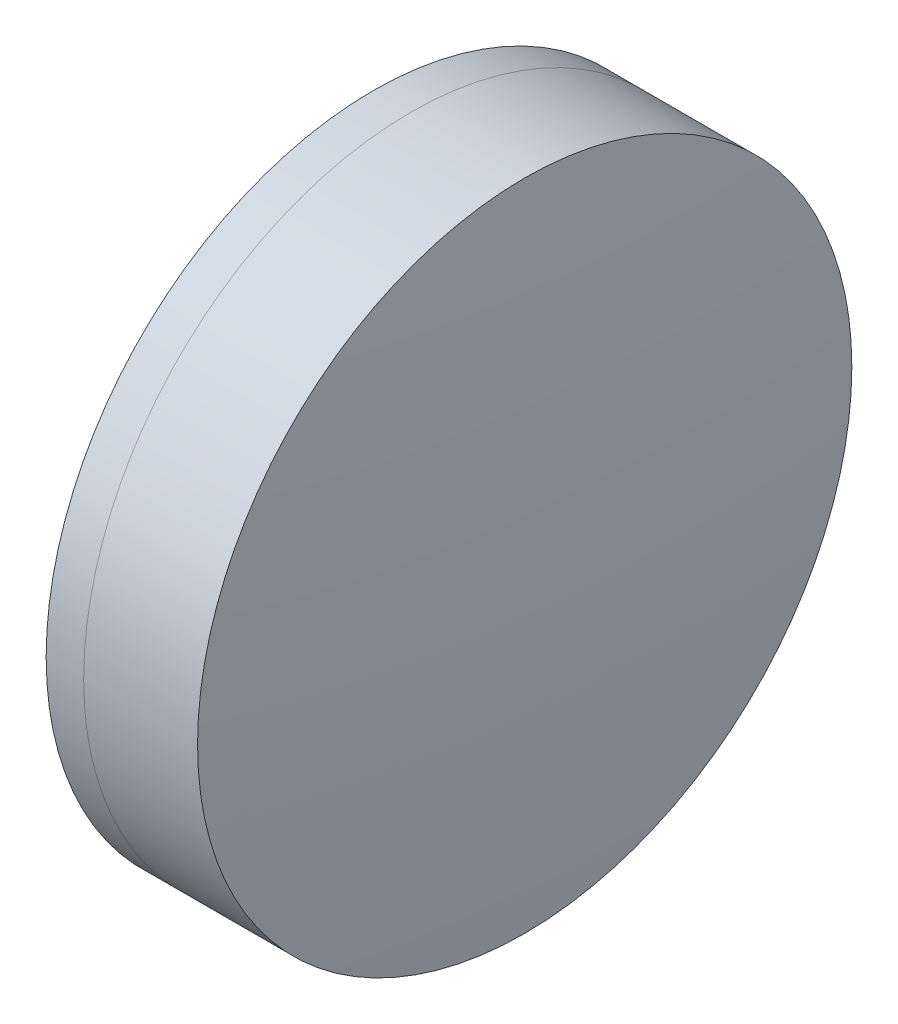
ISO-10303-21;
HEADER;
FILE_DESCRIPTION(('STEP AP214'),'2;1');
FILE_NAME('part.step','',(''),(''),'','','');
FILE_SCHEMA(('AUTOMOTIVE_DESIGN { 1 0 10303 214 1 1 1 1 }'));
ENDSEC;
DATA;
#1=APPLICATION_CONTEXT('core data for automotive mechanical design processes');
#2=APPLICATION_PROTOCOL_DEFINITION('international standard','automotive_design',2000,#1);
#3=PRODUCT_CONTEXT('',#1,'mechanical');
#4=PRODUCT('Part','Part','',(#3));
#5=PRODUCT_RELATED_PRODUCT_CATEGORY('part','',(#4));
#6=PRODUCT_DEFINITION_FORMATION('','',#4);
#7=PRODUCT_DEFINITION_CONTEXT('part definition',#1,'design');
#8=PRODUCT_DEFINITION('design','',#6,#7);
#9=PRODUCT_DEFINITION_SHAPE('','',#8);
#10=(LENGTH_UNIT() NAMED_UNIT(*) SI_UNIT(.MILLI.,.METRE.));
#11=(NAMED_UNIT(*) PLANE_ANGLE_UNIT() SI_UNIT($,.RADIAN.));
#12=(NAMED_UNIT(*) SI_UNIT($,.STERADIAN.) SOLID_ANGLE_UNIT());
#13=UNCERTAINTY_MEASURE_WITH_UNIT(LENGTH_MEASURE(1.E-05),#10,'distance_accuracy_value','');
#14=(GEOMETRIC_REPRESENTATION_CONTEXT(3) GLOBAL_UNCERTAINTY_ASSIGNED_CONTEXT((#13)) GLOBAL_UNIT_ASSIGNED_CONTEXT((#10,
#11,#12)) REPRESENTATION_CONTEXT('',''));
#15=CARTESIAN_POINT('',(0.,0.,0.));
#16=DIRECTION('',(0.,0.,1.));
#17=DIRECTION('',(1.,0.,0.));
#18=AXIS2_PLACEMENT_3D('',#15,#16,#17);
#19=CARTESIAN_POINT('',(264.478986554565,0.,0.));
#20=DIRECTION('',(-1.,0.,0.));
#21=DIRECTION('',(0.,0.,1.));
#22=AXIS2_PLACEMENT_3D('',#19,#20,#21);
#23=SPHERICAL_SURFACE('',#22,25.05);
#24=CARTESIAN_POINT('',(286.07094107471,0.,0.));
#25=DIRECTION('',(-1.,0.,0.));
#26=DIRECTION('',(0.,0.,1.));
#27=AXIS2_PLACEMENT_3D('',#24,#25,#26);
#28=CIRCLE('',#27,12.7);
#29=CARTESIAN_POINT('',(286.07094107471,0.,12.7));
#30=VERTEX_POINT('',#29);
#31=EDGE_CURVE('E11',#30,#30,#28,.T.);
#32=ORIENTED_EDGE('',*,*,#31,.T.);
#33=EDGE_LOOP('',(#32));
#34=FACE_BOUND('',#33,.T.);
#35=ADVANCED_FACE('F45',(#34),#23,.F.);
#36=CARTESIAN_POINT('',(-0.551919992657797,0.,0.));
#37=DIRECTION('',(-1.,0.,0.));
#38=DIRECTION('',(0.,0.,1.));
#39=AXIS2_PLACEMENT_3D('',#36,#37,#38);
#40=CYLINDRICAL_SURFACE('',#39,12.7);
#41=CARTESIAN_POINT('',(290.492693192205,0.,0.));
#42=DIRECTION('',(-1.,0.,0.));
#43=DIRECTION('',(0.,0.,1.));
#44=AXIS2_PLACEMENT_3D('',#41,#42,#43);
#45=CIRCLE('',#44,12.7);
#46=CARTESIAN_POINT('',(290.492693192205,0.,12.7));
#47=VERTEX_POINT('',#46);
#48=EDGE_CURVE('E51',#47,#47,#45,.T.);
#49=ORIENTED_EDGE('',*,*,#48,.T.);
#50=EDGE_LOOP('',(#49));
#51=FACE_BOUND('',#50,.T.);
#52=ORIENTED_EDGE('',*,*,#31,.F.);
#53=EDGE_LOOP('',(#52));
#54=FACE_BOUND('',#53,.T.);
#55=ADVANCED_FACE('F57',(#51,#54),#40,.T.);
#56=CARTESIAN_POINT('',(164.068986554565,0.,0.));
#57=DIRECTION('',(-1.,0.,0.));
#58=DIRECTION('',(0.,0.,1.));
#59=AXIS2_PLACEMENT_3D('',#56,#57,#58);
#60=SPHERICAL_SURFACE('',#59,127.06);
#61=ORIENTED_EDGE('',*,*,#48,.F.);
#62=EDGE_LOOP('',(#61));
#63=FACE_BOUND('',#62,.T.);
#64=ADVANCED_FACE('F60',(#63),#60,.T.);
#65=CLOSED_SHELL('',(#35,#55,#64));
#66=MANIFOLD_SOLID_BREP('B2',#65);
#67=CARTESIAN_POINT('',(311.108986554565,0.,0.));
#68=DIRECTION('',(-1.,0.,0.));
#69=DIRECTION('',(0.,0.,-1.));
#70=AXIS2_PLACEMENT_3D('',#67,#68,#69);
#71=SPHERICAL_SURFACE('',#70,29.38);
#72=CARTESIAN_POINT('',(284.615696838111,0.,0.));
#73=DIRECTION('',(-1.,0.,0.));
#74=DIRECTION('',(0.,0.,1.));
#75=AXIS2_PLACEMENT_3D('',#72,#73,#74);
#76=CIRCLE('',#75,12.7);
#77=CARTESIAN_POINT('',(284.615696838111,0.,12.7));
#78=VERTEX_POINT('',#77);
#79=EDGE_CURVE('E44',#78,#78,#76,.T.);
#80=ORIENTED_EDGE('',*,*,#79,.T.);
#81=EDGE_LOOP('',(#80));
#82=FACE_BOUND('',#81,.T.);
#83=ADVANCED_FACE('F86',(#82),#71,.T.);
#84=CARTESIAN_POINT('',(124.523309526045,0.,0.));
#85=DIRECTION('',(-1.,0.,0.));
#86=DIRECTION('',(0.,0.,1.));
#87=AXIS2_PLACEMENT_3D('',#84,#85,#86);
#88=CYLINDRICAL_SURFACE('',#87,12.7);
#89=CARTESIAN_POINT('',(286.07094107471,0.,0.));
#90=DIRECTION('',(-1.,0.,0.));
#91=DIRECTION('',(0.,0.,1.));
#92=AXIS2_PLACEMENT_3D('',#89,#90,#91);
#93=CIRCLE('',#92,12.7);
#94=CARTESIAN_POINT('',(286.07094107471,0.,12.7));
#95=VERTEX_POINT('',#94);
#96=EDGE_CURVE('E92',#95,#95,#93,.T.);
#97=ORIENTED_EDGE('',*,*,#96,.T.);
#98=EDGE_LOOP('',(#97));
#99=FACE_BOUND('',#98,.T.);
#100=ORIENTED_EDGE('',*,*,#79,.F.);
#101=EDGE_LOOP('',(#100));
#102=FACE_BOUND('',#101,.T.);
#103=ADVANCED_FACE('F98',(#99,#102),#88,.T.);
#104=CARTESIAN_POINT('',(264.478986554565,0.,0.));
#105=DIRECTION('',(-1.,0.,0.));
#106=DIRECTION('',(0.,0.,1.));
#107=AXIS2_PLACEMENT_3D('',#104,#105,#106);
#108=SPHERICAL_SURFACE('',#107,25.05);
#109=ORIENTED_EDGE('',*,*,#96,.F.);
#110=EDGE_LOOP('',(#109));
#111=FACE_BOUND('',#110,.T.);
#112=ADVANCED_FACE('F101',(#111),#108,.T.);
#113=CLOSED_SHELL('',(#83,#103,#112));
#114=MANIFOLD_SOLID_BREP('B6',#113);
#115=ADVANCED_BREP_SHAPE_REPRESENTATION('',(#18,#66,#114),#14);
#116=SHAPE_DEFINITION_REPRESENTATION(#9,#115);
ENDSEC;
END-ISO-10303-21;
